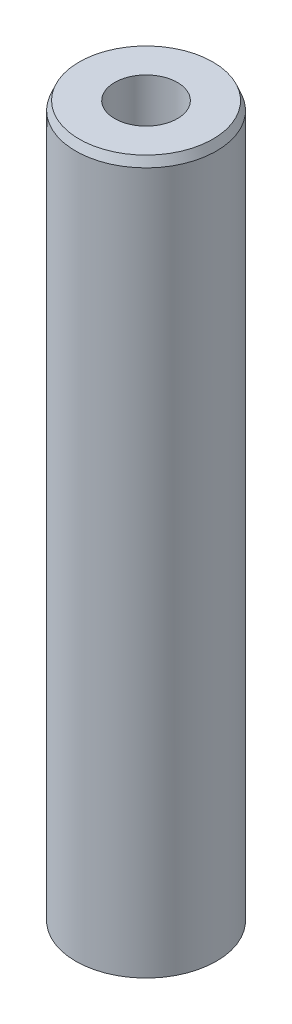
ISO-10303-21;
HEADER;
FILE_DESCRIPTION(('STEP AP214'),'2;1');
FILE_NAME('part.step','',(''),(''),'','','');
FILE_SCHEMA(('AUTOMOTIVE_DESIGN { 1 0 10303 214 1 1 1 1 }'));
ENDSEC;
DATA;
#1=APPLICATION_CONTEXT('core data for automotive mechanical design processes');
#2=APPLICATION_PROTOCOL_DEFINITION('international standard','automotive_design',2000,#1);
#3=PRODUCT_CONTEXT('',#1,'mechanical');
#4=PRODUCT('Part','Part','',(#3));
#5=PRODUCT_RELATED_PRODUCT_CATEGORY('part','',(#4));
#6=PRODUCT_DEFINITION_FORMATION('','',#4);
#7=PRODUCT_DEFINITION_CONTEXT('part definition',#1,'design');
#8=PRODUCT_DEFINITION('design','',#6,#7);
#9=PRODUCT_DEFINITION_SHAPE('','',#8);
#10=(LENGTH_UNIT() NAMED_UNIT(*) SI_UNIT(.MILLI.,.METRE.));
#11=(NAMED_UNIT(*) PLANE_ANGLE_UNIT() SI_UNIT($,.RADIAN.));
#12=(NAMED_UNIT(*) SI_UNIT($,.STERADIAN.) SOLID_ANGLE_UNIT());
#13=UNCERTAINTY_MEASURE_WITH_UNIT(LENGTH_MEASURE(1.E-05),#10,'distance_accuracy_value','');
#14=(GEOMETRIC_REPRESENTATION_CONTEXT(3) GLOBAL_UNCERTAINTY_ASSIGNED_CONTEXT((#13)) GLOBAL_UNIT_ASSIGNED_CONTEXT((#10,
#11,#12)) REPRESENTATION_CONTEXT('',''));
#15=CARTESIAN_POINT('',(0.,0.,0.));
#16=DIRECTION('',(0.,0.,1.));
#17=DIRECTION('',(1.,0.,0.));
#18=AXIS2_PLACEMENT_3D('',#15,#16,#17);
#19=CARTESIAN_POINT('',(0.,380.440647834144,0.));
#20=DIRECTION('',(0.,-1.,0.));
#21=DIRECTION('',(0.,0.,-1.));
#22=AXIS2_PLACEMENT_3D('',#19,#20,#21);
#23=CYLINDRICAL_SURFACE('',#22,37.5);
#24=CARTESIAN_POINT('',(0.,375.848306591154,0.));
#25=DIRECTION('',(0.,1.,0.));
#26=DIRECTION('',(0.,0.,1.));
#27=AXIS2_PLACEMENT_3D('',#24,#25,#26);
#28=CIRCLE('',#27,37.5);
#29=CARTESIAN_POINT('',(0.,375.848306591154,-37.5));
#30=VERTEX_POINT('',#29);
#31=EDGE_CURVE('E50',#30,#30,#28,.F.);
#32=ORIENTED_EDGE('',*,*,#31,.T.);
#33=EDGE_LOOP('',(#32));
#34=FACE_BOUND('',#33,.T.);
#35=CARTESIAN_POINT('',(0.,1.86445030593418,0.));
#36=DIRECTION('',(0.,1.,0.));
#37=DIRECTION('',(0.,0.,1.));
#38=AXIS2_PLACEMENT_3D('',#35,#36,#37);
#39=CIRCLE('',#38,37.5);
#40=CARTESIAN_POINT('',(0.,1.86445030593418,37.5));
#41=VERTEX_POINT('',#40);
#42=EDGE_CURVE('E51',#41,#41,#39,.T.);
#43=ORIENTED_EDGE('',*,*,#42,.T.);
#44=EDGE_LOOP('',(#43));
#45=FACE_BOUND('',#44,.T.);
#46=ADVANCED_FACE('F39',(#34,#45),#23,.T.);
#47=CARTESIAN_POINT('',(0.,380.440647834144,0.));
#48=DIRECTION('',(0.,1.,0.));
#49=DIRECTION('',(0.,0.,1.));
#50=AXIS2_PLACEMENT_3D('',#47,#48,#49);
#51=PLANE('',#50);
#52=CARTESIAN_POINT('',(0.,380.440647834144,0.));
#53=DIRECTION('',(0.,1.,0.));
#54=DIRECTION('',(0.,0.,1.));
#55=AXIS2_PLACEMENT_3D('',#52,#53,#54);
#56=CIRCLE('',#55,35.6355496940658);
#57=CARTESIAN_POINT('',(0.,380.440647834144,-35.6355496940658));
#58=VERTEX_POINT('',#57);
#59=EDGE_CURVE('E54',#58,#58,#56,.T.);
#60=ORIENTED_EDGE('',*,*,#59,.T.);
#61=EDGE_LOOP('',(#60));
#62=FACE_BOUND('',#61,.T.);
#63=CARTESIAN_POINT('',(0.,380.440647834144,0.));
#64=DIRECTION('',(0.,1.,0.));
#65=DIRECTION('',(0.,0.,1.));
#66=AXIS2_PLACEMENT_3D('',#63,#64,#65);
#67=CIRCLE('',#66,16.7259783668491);
#68=CARTESIAN_POINT('',(0.,380.440647834144,16.7259783668491));
#69=VERTEX_POINT('',#68);
#70=EDGE_CURVE('E58',#69,#69,#67,.T.);
#71=ORIENTED_EDGE('',*,*,#70,.F.);
#72=EDGE_LOOP('',(#71));
#73=FACE_BOUND('',#72,.T.);
#74=ADVANCED_FACE('F69',(#62,#73),#51,.T.);
#75=CARTESIAN_POINT('',(0.,0.,0.));
#76=DIRECTION('',(0.,1.,0.));
#77=DIRECTION('',(0.,0.,1.));
#78=AXIS2_PLACEMENT_3D('',#75,#76,#77);
#79=PLANE('',#78);
#80=CARTESIAN_POINT('',(0.,0.,0.));
#81=DIRECTION('',(0.,1.,0.));
#82=DIRECTION('',(0.,0.,1.));
#83=AXIS2_PLACEMENT_3D('',#80,#81,#82);
#84=CIRCLE('',#83,32.90765875701);
#85=CARTESIAN_POINT('',(0.,0.,32.90765875701));
#86=VERTEX_POINT('',#85);
#87=EDGE_CURVE('E10',#86,#86,#84,.F.);
#88=ORIENTED_EDGE('',*,*,#87,.T.);
#89=EDGE_LOOP('',(#88));
#90=FACE_BOUND('',#89,.T.);
#91=CARTESIAN_POINT('',(0.,0.,0.));
#92=DIRECTION('',(0.,1.,0.));
#93=DIRECTION('',(0.,0.,1.));
#94=AXIS2_PLACEMENT_3D('',#91,#92,#93);
#95=CIRCLE('',#94,16.7259783668491);
#96=CARTESIAN_POINT('',(0.,0.,16.7259783668491));
#97=VERTEX_POINT('',#96);
#98=EDGE_CURVE('E63',#97,#97,#95,.T.);
#99=ORIENTED_EDGE('',*,*,#98,.T.);
#100=EDGE_LOOP('',(#99));
#101=FACE_BOUND('',#100,.T.);
#102=ADVANCED_FACE('F75',(#90,#101),#79,.F.);
#103=CARTESIAN_POINT('',(0.,380.440647834144,0.));
#104=DIRECTION('',(0.,-1.,0.));
#105=DIRECTION('',(0.,0.,-1.));
#106=AXIS2_PLACEMENT_3D('',#103,#104,#105);
#107=CYLINDRICAL_SURFACE('',#106,16.7259783668491);
#108=ORIENTED_EDGE('',*,*,#70,.T.);
#109=EDGE_LOOP('',(#108));
#110=FACE_BOUND('',#109,.T.);
#111=ORIENTED_EDGE('',*,*,#98,.F.);
#112=EDGE_LOOP('',(#111));
#113=FACE_BOUND('',#112,.T.);
#114=ADVANCED_FACE('F70',(#110,#113),#107,.F.);
#115=CARTESIAN_POINT('',(0.,380.440647834144,0.));
#116=DIRECTION('',(0.,-1.,0.));
#117=DIRECTION('',(0.,0.,-1.));
#118=AXIS2_PLACEMENT_3D('',#115,#116,#117);
#119=CONICAL_SURFACE('',#118,35.6355496940658,0.385660543384701);
#120=CARTESIAN_POINT('',(0.,375.848306591154,-37.5));
#121=CARTESIAN_POINT('',(0.,375.896143479102,-37.4805786426465));
#122=CARTESIAN_POINT('',(0.,375.94398036705,-37.4611572852931));
#123=CARTESIAN_POINT('',(0.,376.039654142945,-37.4223145705861));
#124=CARTESIAN_POINT('',(0.,376.087491030893,-37.4028932132326));
#125=CARTESIAN_POINT('',(0.,376.183164806789,-37.3640504985256));
#126=CARTESIAN_POINT('',(0.,376.231001694737,-37.3446291411722));
#127=CARTESIAN_POINT('',(0.,376.326675470632,-37.3057864264652));
#128=CARTESIAN_POINT('',(0.,376.37451235858,-37.2863650691117));
#129=CARTESIAN_POINT('',(0.,376.470186134476,-37.2475223544048));
#130=CARTESIAN_POINT('',(0.,376.518023022424,-37.2281009970513));
#131=CARTESIAN_POINT('',(0.,376.613696798319,-37.1892582823443));
#132=CARTESIAN_POINT('',(0.,376.661533686267,-37.1698369249908));
#133=CARTESIAN_POINT('',(0.,376.757207462163,-37.1309942102839));
#134=CARTESIAN_POINT('',(0.,376.80504435011,-37.1115728529304));
#135=CARTESIAN_POINT('',(0.,376.900718126006,-37.0727301382234));
#136=CARTESIAN_POINT('',(0.,376.948555013954,-37.0533087808699));
#137=CARTESIAN_POINT('',(0.,377.044228789849,-37.014466066163));
#138=CARTESIAN_POINT('',(0.,377.092065677797,-36.9950447088095));
#139=CARTESIAN_POINT('',(0.,377.187739453693,-36.9562019941025));
#140=CARTESIAN_POINT('',(0.,377.235576341641,-36.936780636749));
#141=CARTESIAN_POINT('',(0.,377.331250117536,-36.8979379220421));
#142=CARTESIAN_POINT('',(0.,377.379087005484,-36.8785165646886));
#143=CARTESIAN_POINT('',(0.,377.47476078138,-36.8396738499816));
#144=CARTESIAN_POINT('',(0.,377.522597669328,-36.8202524926282));
#145=CARTESIAN_POINT('',(0.,377.618271445223,-36.7814097779212));
#146=CARTESIAN_POINT('',(0.,377.666108333171,-36.7619884205677));
#147=CARTESIAN_POINT('',(0.,377.761782109067,-36.7231457058607));
#148=CARTESIAN_POINT('',(0.,377.809618997014,-36.7037243485073));
#149=CARTESIAN_POINT('',(0.,377.90529277291,-36.6648816338003));
#150=CARTESIAN_POINT('',(0.,377.953129660858,-36.6454602764468));
#151=CARTESIAN_POINT('',(0.,378.048803436754,-36.6066175617399));
#152=CARTESIAN_POINT('',(0.,378.096640324701,-36.5871962043864));
#153=CARTESIAN_POINT('',(0.,378.192314100597,-36.5483534896794));
#154=CARTESIAN_POINT('',(0.,378.240150988545,-36.5289321323259));
#155=CARTESIAN_POINT('',(0.,378.33582476444,-36.490089417619));
#156=CARTESIAN_POINT('',(0.,378.383661652388,-36.4706680602655));
#157=CARTESIAN_POINT('',(0.,378.479335428284,-36.4318253455585));
#158=CARTESIAN_POINT('',(0.,378.527172316232,-36.412403988205));
#159=CARTESIAN_POINT('',(0.,378.622846092127,-36.3735612734981));
#160=CARTESIAN_POINT('',(0.,378.670682980075,-36.3541399161446));
#161=CARTESIAN_POINT('',(0.,378.766356755971,-36.3152972014376));
#162=CARTESIAN_POINT('',(0.,378.814193643919,-36.2958758440842));
#163=CARTESIAN_POINT('',(0.,378.909867419814,-36.2570331293772));
#164=CARTESIAN_POINT('',(0.,378.957704307762,-36.2376117720237));
#165=CARTESIAN_POINT('',(0.,379.053378083658,-36.1987690573167));
#166=CARTESIAN_POINT('',(0.,379.101214971605,-36.1793476999633));
#167=CARTESIAN_POINT('',(0.,379.196888747501,-36.1405049852563));
#168=CARTESIAN_POINT('',(0.,379.244725635449,-36.1210836279028));
#169=CARTESIAN_POINT('',(0.,379.340399411345,-36.0822409131959));
#170=CARTESIAN_POINT('',(0.,379.388236299292,-36.0628195558424));
#171=CARTESIAN_POINT('',(0.,379.483910075188,-36.0239768411354));
#172=CARTESIAN_POINT('',(0.,379.531746963136,-36.0045554837819));
#173=CARTESIAN_POINT('',(0.,379.627420739031,-35.965712769075));
#174=CARTESIAN_POINT('',(0.,379.675257626979,-35.9462914117215));
#175=CARTESIAN_POINT('',(0.,379.770931402875,-35.9074486970145));
#176=CARTESIAN_POINT('',(0.,379.818768290823,-35.888027339661));
#177=CARTESIAN_POINT('',(0.,379.914442066718,-35.8491846249541));
#178=CARTESIAN_POINT('',(0.,379.962278954666,-35.8297632676006));
#179=CARTESIAN_POINT('',(0.,380.057952730562,-35.7909205528936));
#180=CARTESIAN_POINT('',(0.,380.10578961851,-35.7714991955401));
#181=CARTESIAN_POINT('',(0.,380.201463394405,-35.7326564808332));
#182=CARTESIAN_POINT('',(0.,380.249300282353,-35.7132351234797));
#183=CARTESIAN_POINT('',(0.,380.344974058249,-35.6743924087727));
#184=CARTESIAN_POINT('',(0.,380.392810946197,-35.6549710514193));
#185=CARTESIAN_POINT('',(0.,380.440647834144,-35.6355496940658));
#186=B_SPLINE_CURVE_WITH_KNOTS('',3,(#120,#121,#122,#123,#124,#125,#126,#127,#128,#129,#130,
#131,#132,#133,#134,#135,#136,#137,#138,#139,#140,#141,#142,#143,#144,#145,#146,#147,#148,#149,
#150,#151,#152,#153,#154,#155,#156,#157,#158,#159,#160,#161,#162,#163,#164,#165,#166,#167,#168,
#169,#170,#171,#172,#173,#174,#175,#176,#177,#178,#179,#180,#181,#182,#183,#184,#185),
.UNSPECIFIED.,.F.,.F.,(4,2,2,2,2,2,2,2,2,2,2,2,2,2,2,2,2,2,2,2,2,2,2,2,2,2,2,2,2,2,2,2,4),(0.,
0.154887096718434,0.309774193436814,0.464661290155194,0.619548386873574,0.774435483591956,
0.929322580310336,1.08420967702872,1.2390967737471,1.39398387046553,1.54887096718391,
1.70375806390229,1.85864516062067,2.01353225733905,2.16841935405743,2.32330645077581,
2.47819354749419,2.63308064421263,2.78796774093101,2.94285483764939,3.09774193436777,
3.25262903108615,3.40751612780453,3.56240322452291,3.71729032124129,3.87217741795972,
4.0270645146781,4.18195161139648,4.33683870811486,4.49172580483325,4.64661290155163,
4.80149999827001,4.95638709498844),.UNSPECIFIED.);
#187=EDGE_CURVE('BSEAM81',#30,#58,#186,.T.);
#188=ORIENTED_EDGE('',*,*,#31,.F.);
#189=ORIENTED_EDGE('',*,*,#59,.F.);
#190=ORIENTED_EDGE('',*,*,#187,.T.);
#191=ORIENTED_EDGE('',*,*,#187,.F.);
#192=EDGE_LOOP('',(#188,#190,#189,#191));
#193=FACE_BOUND('',#192,.T.);
#194=ADVANCED_FACE('F81',(#193),#119,.T.);
#195=CARTESIAN_POINT('',(0.,1.86445030593418,0.));
#196=DIRECTION('',(0.,1.,0.));
#197=DIRECTION('',(0.,0.,1.));
#198=AXIS2_PLACEMENT_3D('',#195,#196,#197);
#199=CONICAL_SURFACE('',#198,37.5,1.18513578341019);
#200=ORIENTED_EDGE('',*,*,#87,.F.);
#201=EDGE_LOOP('',(#200));
#202=FACE_BOUND('',#201,.T.);
#203=ORIENTED_EDGE('',*,*,#42,.F.);
#204=EDGE_LOOP('',(#203));
#205=FACE_BOUND('',#204,.T.);
#206=ADVANCED_FACE('F45',(#202,#205),#199,.T.);
#207=CLOSED_SHELL('',(#46,#74,#102,#114,#194,#206));
#208=MANIFOLD_SOLID_BREP('B2',#207);
#209=ADVANCED_BREP_SHAPE_REPRESENTATION('',(#18,#208),#14);
#210=SHAPE_DEFINITION_REPRESENTATION(#9,#209);
ENDSEC;
END-ISO-10303-21;
